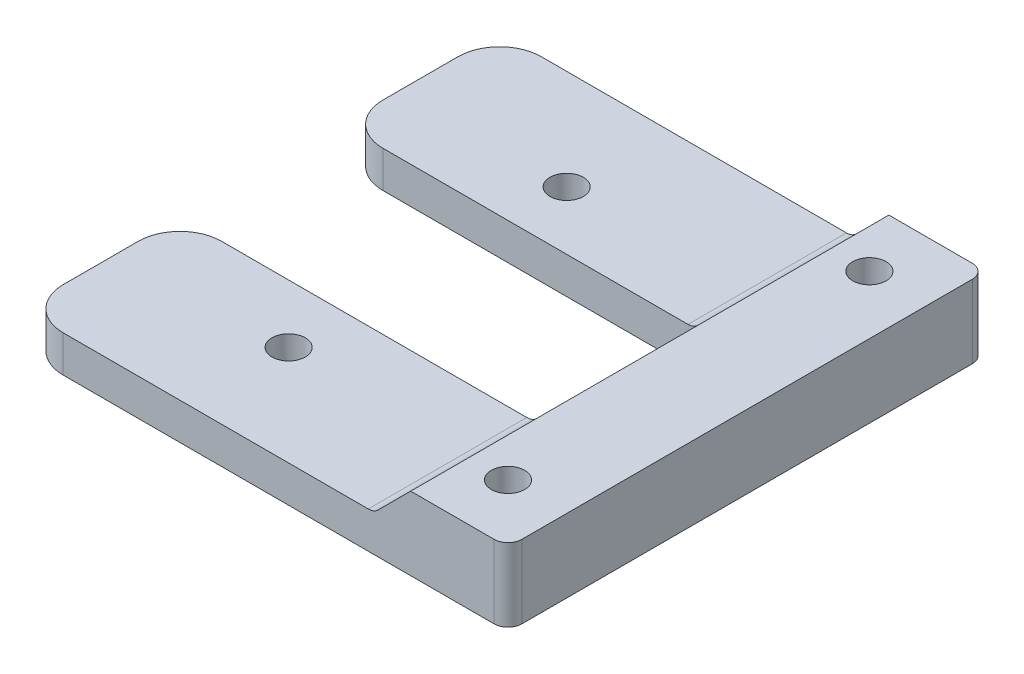
ISO-10303-21;
HEADER;
FILE_DESCRIPTION(('STEP AP214'),'2;1');
FILE_NAME('part.step','',(''),(''),'','','');
FILE_SCHEMA(('AUTOMOTIVE_DESIGN { 1 0 10303 214 1 1 1 1 }'));
ENDSEC;
DATA;
#1=APPLICATION_CONTEXT('core data for automotive mechanical design processes');
#2=APPLICATION_PROTOCOL_DEFINITION('international standard','automotive_design',2000,#1);
#3=PRODUCT_CONTEXT('',#1,'mechanical');
#4=PRODUCT('Part','Part','',(#3));
#5=PRODUCT_RELATED_PRODUCT_CATEGORY('part','',(#4));
#6=PRODUCT_DEFINITION_FORMATION('','',#4);
#7=PRODUCT_DEFINITION_CONTEXT('part definition',#1,'design');
#8=PRODUCT_DEFINITION('design','',#6,#7);
#9=PRODUCT_DEFINITION_SHAPE('','',#8);
#10=(LENGTH_UNIT() NAMED_UNIT(*) SI_UNIT(.MILLI.,.METRE.));
#11=(NAMED_UNIT(*) PLANE_ANGLE_UNIT() SI_UNIT($,.RADIAN.));
#12=(NAMED_UNIT(*) SI_UNIT($,.STERADIAN.) SOLID_ANGLE_UNIT());
#13=UNCERTAINTY_MEASURE_WITH_UNIT(LENGTH_MEASURE(1.E-05),#10,'distance_accuracy_value','');
#14=(GEOMETRIC_REPRESENTATION_CONTEXT(3) GLOBAL_UNCERTAINTY_ASSIGNED_CONTEXT((#13)) GLOBAL_UNIT_ASSIGNED_CONTEXT((#10,
#11,#12)) REPRESENTATION_CONTEXT('',''));
#15=CARTESIAN_POINT('',(0.,0.,0.));
#16=DIRECTION('',(0.,0.,1.));
#17=DIRECTION('',(1.,0.,0.));
#18=AXIS2_PLACEMENT_3D('',#15,#16,#17);
#19=CARTESIAN_POINT('',(0.,-2.635,17.2));
#20=DIRECTION('',(0.,-1.,0.));
#21=DIRECTION('',(1.,0.,0.));
#22=AXIS2_PLACEMENT_3D('',#19,#20,#21);
#23=PLANE('',#22);
#24=CARTESIAN_POINT('',(-22.979761,-2.635,10.));
#25=DIRECTION('',(0.,1.,0.));
#26=DIRECTION('',(-1.,0.,0.));
#27=AXIS2_PLACEMENT_3D('',#24,#25,#26);
#28=CIRCLE('',#27,1.2);
#29=CARTESIAN_POINT('',(-24.179761,-2.635,10.));
#30=VERTEX_POINT('',#29);
#31=EDGE_CURVE('E578',#30,#30,#28,.T.);
#32=ORIENTED_EDGE('',*,*,#31,.F.);
#33=EDGE_LOOP('',(#32));
#34=FACE_BOUND('',#33,.T.);
#35=DIRECTION('',(0.,0.,-1.));
#36=VECTOR('',#35,1.);
#37=CARTESIAN_POINT('',(-35.,-2.63500000000002,17.2));
#38=LINE('',#37,#36);
#39=CARTESIAN_POINT('',(-35.,-2.63500000000002,14.2));
#40=VERTEX_POINT('',#39);
#41=CARTESIAN_POINT('',(-35.,-2.63500000000002,8.8));
#42=VERTEX_POINT('',#41);
#43=EDGE_CURVE('E231',#40,#42,#38,.T.);
#44=ORIENTED_EDGE('',*,*,#43,.F.);
#45=CARTESIAN_POINT('',(-32.,-2.63500000000002,14.2));
#46=DIRECTION('',(0.,-1.,0.));
#47=DIRECTION('',(1.,0.,0.));
#48=AXIS2_PLACEMENT_3D('',#45,#46,#47);
#49=CIRCLE('',#48,3.);
#50=CARTESIAN_POINT('',(-32.,-2.63500000000002,17.2));
#51=VERTEX_POINT('',#50);
#52=EDGE_CURVE('E317',#40,#51,#49,.F.);
#53=ORIENTED_EDGE('',*,*,#52,.T.);
#54=DIRECTION('',(-1.,0.,0.));
#55=VECTOR('',#54,1.);
#56=CARTESIAN_POINT('',(0.,-2.635,17.2));
#57=LINE('',#56,#55);
#58=CARTESIAN_POINT('',(-10.0492135623731,-2.635,17.2));
#59=VERTEX_POINT('',#58);
#60=EDGE_CURVE('E382',#59,#51,#57,.T.);
#61=ORIENTED_EDGE('',*,*,#60,.F.);
#62=DIRECTION('',(0.,0.,1.));
#63=VECTOR('',#62,1.);
#64=CARTESIAN_POINT('',(-10.0492135623731,-2.635,5.8));
#65=LINE('',#64,#63);
#66=CARTESIAN_POINT('',(-10.0492135623731,-2.635,5.8));
#67=VERTEX_POINT('',#66);
#68=EDGE_CURVE('E238',#59,#67,#65,.F.);
#69=ORIENTED_EDGE('',*,*,#68,.T.);
#70=DIRECTION('',(1.,0.,0.));
#71=VECTOR('',#70,1.);
#72=CARTESIAN_POINT('',(-35.,-2.635,5.8));
#73=LINE('',#72,#71);
#74=CARTESIAN_POINT('',(-32.,-2.635,5.8));
#75=VERTEX_POINT('',#74);
#76=EDGE_CURVE('E447',#75,#67,#73,.T.);
#77=ORIENTED_EDGE('',*,*,#76,.F.);
#78=CARTESIAN_POINT('',(-32.,-2.63500000000002,8.8));
#79=DIRECTION('',(0.,-1.,0.));
#80=DIRECTION('',(1.,0.,0.));
#81=AXIS2_PLACEMENT_3D('',#78,#79,#80);
#82=CIRCLE('',#81,3.);
#83=EDGE_CURVE('E314',#75,#42,#82,.F.);
#84=ORIENTED_EDGE('',*,*,#83,.T.);
#85=EDGE_LOOP('',(#44,#53,#61,#69,#77,#84));
#86=FACE_BOUND('',#85,.T.);
#87=ADVANCED_FACE('F50',(#34,#86),#23,.F.);
#88=CARTESIAN_POINT('',(-35.,0.,17.2));
#89=DIRECTION('',(1.,0.,0.));
#90=DIRECTION('',(0.,0.,-1.));
#91=AXIS2_PLACEMENT_3D('',#88,#89,#90);
#92=PLANE('',#91);
#93=DIRECTION('',(0.,0.,-1.));
#94=VECTOR('',#93,1.);
#95=CARTESIAN_POINT('',(-35.,-5.27,17.2));
#96=LINE('',#95,#94);
#97=CARTESIAN_POINT('',(-35.,-5.27,14.2));
#98=VERTEX_POINT('',#97);
#99=CARTESIAN_POINT('',(-35.,-5.27,8.8));
#100=VERTEX_POINT('',#99);
#101=EDGE_CURVE('E404',#98,#100,#96,.T.);
#102=ORIENTED_EDGE('',*,*,#101,.F.);
#103=DIRECTION('',(0.,-1.,0.));
#104=VECTOR('',#103,1.);
#105=CARTESIAN_POINT('',(-35.,-2.63500000000002,14.2));
#106=LINE('',#105,#104);
#107=EDGE_CURVE('E311',#98,#40,#106,.F.);
#108=ORIENTED_EDGE('',*,*,#107,.T.);
#109=ORIENTED_EDGE('',*,*,#43,.T.);
#110=DIRECTION('',(0.,1.,0.));
#111=VECTOR('',#110,1.);
#112=CARTESIAN_POINT('',(-35.,0.,8.8));
#113=LINE('',#112,#111);
#114=EDGE_CURVE('E308',#42,#100,#113,.F.);
#115=ORIENTED_EDGE('',*,*,#114,.T.);
#116=EDGE_LOOP('',(#102,#108,#109,#115));
#117=FACE_BOUND('',#116,.T.);
#118=ADVANCED_FACE('F423',(#117),#92,.F.);
#119=CARTESIAN_POINT('',(-22.979761,-2.635,-10.));
#120=DIRECTION('',(0.,1.,0.));
#121=DIRECTION('',(-1.,0.,0.));
#122=AXIS2_PLACEMENT_3D('',#119,#120,#121);
#123=CIRCLE('',#122,1.2);
#124=CARTESIAN_POINT('',(-24.179761,-2.635,-10.));
#125=VERTEX_POINT('',#124);
#126=EDGE_CURVE('E510',#125,#125,#123,.T.);
#127=ORIENTED_EDGE('',*,*,#126,.F.);
#128=EDGE_LOOP('',(#127));
#129=FACE_BOUND('',#128,.T.);
#130=CARTESIAN_POINT('',(-35.,-2.63500000000002,-8.8));
#131=VERTEX_POINT('',#130);
#132=CARTESIAN_POINT('',(-35.,-2.63500000000002,-14.2));
#133=VERTEX_POINT('',#132);
#134=EDGE_CURVE('E407',#131,#133,#38,.T.);
#135=ORIENTED_EDGE('',*,*,#134,.F.);
#136=CARTESIAN_POINT('',(-32.,-2.63500000000002,-8.8));
#137=DIRECTION('',(0.,-1.,0.));
#138=DIRECTION('',(1.,0.,0.));
#139=AXIS2_PLACEMENT_3D('',#136,#137,#138);
#140=CIRCLE('',#139,3.);
#141=CARTESIAN_POINT('',(-32.,-2.635,-5.8));
#142=VERTEX_POINT('',#141);
#143=EDGE_CURVE('E335',#131,#142,#140,.F.);
#144=ORIENTED_EDGE('',*,*,#143,.T.);
#145=DIRECTION('',(-1.,0.,0.));
#146=VECTOR('',#145,1.);
#147=CARTESIAN_POINT('',(-35.,-2.635,-5.8));
#148=LINE('',#147,#146);
#149=CARTESIAN_POINT('',(-10.0492135623731,-2.635,-5.8));
#150=VERTEX_POINT('',#149);
#151=EDGE_CURVE('E439',#150,#142,#148,.T.);
#152=ORIENTED_EDGE('',*,*,#151,.F.);
#153=DIRECTION('',(0.,0.,1.));
#154=VECTOR('',#153,1.);
#155=CARTESIAN_POINT('',(-10.0492135623731,-2.635,-17.2));
#156=LINE('',#155,#154);
#157=CARTESIAN_POINT('',(-10.0492135623731,-2.635,-17.2));
#158=VERTEX_POINT('',#157);
#159=EDGE_CURVE('E244',#150,#158,#156,.F.);
#160=ORIENTED_EDGE('',*,*,#159,.T.);
#161=DIRECTION('',(-1.,0.,0.));
#162=VECTOR('',#161,1.);
#163=CARTESIAN_POINT('',(0.,-2.635,-17.2));
#164=LINE('',#163,#162);
#165=CARTESIAN_POINT('',(-32.,-2.63500000000002,-17.2));
#166=VERTEX_POINT('',#165);
#167=EDGE_CURVE('E391',#158,#166,#164,.T.);
#168=ORIENTED_EDGE('',*,*,#167,.T.);
#169=CARTESIAN_POINT('',(-32.,-2.63500000000002,-14.2));
#170=DIRECTION('',(0.,-1.,0.));
#171=DIRECTION('',(1.,0.,0.));
#172=AXIS2_PLACEMENT_3D('',#169,#170,#171);
#173=CIRCLE('',#172,3.);
#174=EDGE_CURVE('E332',#166,#133,#173,.F.);
#175=ORIENTED_EDGE('',*,*,#174,.T.);
#176=EDGE_LOOP('',(#135,#144,#152,#160,#168,#175));
#177=FACE_BOUND('',#176,.T.);
#178=ADVANCED_FACE('F494',(#129,#177),#23,.F.);
#179=CARTESIAN_POINT('',(-35.,-5.27,-8.8));
#180=VERTEX_POINT('',#179);
#181=CARTESIAN_POINT('',(-35.,-5.27,-14.2));
#182=VERTEX_POINT('',#181);
#183=EDGE_CURVE('E403',#180,#182,#96,.T.);
#184=ORIENTED_EDGE('',*,*,#183,.F.);
#185=DIRECTION('',(0.,1.,0.));
#186=VECTOR('',#185,1.);
#187=CARTESIAN_POINT('',(-35.,0.,-8.8));
#188=LINE('',#187,#186);
#189=EDGE_CURVE('E328',#180,#131,#188,.T.);
#190=ORIENTED_EDGE('',*,*,#189,.T.);
#191=ORIENTED_EDGE('',*,*,#134,.T.);
#192=DIRECTION('',(0.,-1.,0.));
#193=VECTOR('',#192,1.);
#194=CARTESIAN_POINT('',(-35.,0.,-14.2));
#195=LINE('',#194,#193);
#196=EDGE_CURVE('E324',#133,#182,#195,.T.);
#197=ORIENTED_EDGE('',*,*,#196,.T.);
#198=EDGE_LOOP('',(#184,#190,#191,#197));
#199=FACE_BOUND('',#198,.T.);
#200=ADVANCED_FACE('F499',(#199),#92,.F.);
#201=CARTESIAN_POINT('',(0.,-5.27,17.2));
#202=DIRECTION('',(0.,-1.,0.));
#203=DIRECTION('',(1.,0.,0.));
#204=AXIS2_PLACEMENT_3D('',#201,#202,#203);
#205=PLANE('',#204);
#206=CARTESIAN_POINT('',(-22.979761,-5.27,10.));
#207=DIRECTION('',(0.,-1.,0.));
#208=DIRECTION('',(1.,0.,0.));
#209=AXIS2_PLACEMENT_3D('',#206,#207,#208);
#210=CIRCLE('',#209,1.2);
#211=CARTESIAN_POINT('',(-21.779761,-5.27,10.));
#212=VERTEX_POINT('',#211);
#213=EDGE_CURVE('E572',#212,#212,#210,.F.);
#214=ORIENTED_EDGE('',*,*,#213,.T.);
#215=EDGE_LOOP('',(#214));
#216=FACE_BOUND('',#215,.T.);
#217=CARTESIAN_POINT('',(-22.979761,-5.27,-10.));
#218=DIRECTION('',(0.,-1.,0.));
#219=DIRECTION('',(1.,0.,0.));
#220=AXIS2_PLACEMENT_3D('',#217,#218,#219);
#221=CIRCLE('',#220,1.2);
#222=CARTESIAN_POINT('',(-21.779761,-5.27,-10.));
#223=VERTEX_POINT('',#222);
#224=EDGE_CURVE('E450',#223,#223,#221,.F.);
#225=ORIENTED_EDGE('',*,*,#224,.T.);
#226=EDGE_LOOP('',(#225));
#227=FACE_BOUND('',#226,.T.);
#228=DIRECTION('',(0.,0.,-1.));
#229=VECTOR('',#228,1.);
#230=CARTESIAN_POINT('',(0.,-5.27,17.2));
#231=LINE('',#230,#229);
#232=CARTESIAN_POINT('',(0.,-5.27,16.2));
#233=VERTEX_POINT('',#232);
#234=CARTESIAN_POINT('',(0.,-5.27,-16.2));
#235=VERTEX_POINT('',#234);
#236=EDGE_CURVE('E372',#233,#235,#231,.T.);
#237=ORIENTED_EDGE('',*,*,#236,.F.);
#238=CARTESIAN_POINT('',(-1.,-5.27,16.2));
#239=DIRECTION('',(0.,-1.,0.));
#240=DIRECTION('',(1.,0.,0.));
#241=AXIS2_PLACEMENT_3D('',#238,#239,#240);
#242=CIRCLE('',#241,1.);
#243=CARTESIAN_POINT('',(-1.,-5.27,17.2));
#244=VERTEX_POINT('',#243);
#245=EDGE_CURVE('E354',#233,#244,#242,.T.);
#246=ORIENTED_EDGE('',*,*,#245,.T.);
#247=DIRECTION('',(-1.,0.,0.));
#248=VECTOR('',#247,1.);
#249=CARTESIAN_POINT('',(0.,-5.27,17.2));
#250=LINE('',#249,#248);
#251=CARTESIAN_POINT('',(-32.,-5.27,17.2));
#252=VERTEX_POINT('',#251);
#253=EDGE_CURVE('E203',#244,#252,#250,.T.);
#254=ORIENTED_EDGE('',*,*,#253,.T.);
#255=CARTESIAN_POINT('',(-32.,-5.27,14.2));
#256=DIRECTION('',(0.,-1.,0.));
#257=DIRECTION('',(1.,0.,0.));
#258=AXIS2_PLACEMENT_3D('',#255,#256,#257);
#259=CIRCLE('',#258,3.);
#260=EDGE_CURVE('E305',#252,#98,#259,.T.);
#261=ORIENTED_EDGE('',*,*,#260,.T.);
#262=ORIENTED_EDGE('',*,*,#101,.T.);
#263=CARTESIAN_POINT('',(-32.,-5.27,8.8));
#264=DIRECTION('',(0.,-1.,0.));
#265=DIRECTION('',(1.,0.,0.));
#266=AXIS2_PLACEMENT_3D('',#263,#264,#265);
#267=CIRCLE('',#266,3.);
#268=CARTESIAN_POINT('',(-32.,-5.27,5.8));
#269=VERTEX_POINT('',#268);
#270=EDGE_CURVE('E302',#100,#269,#267,.T.);
#271=ORIENTED_EDGE('',*,*,#270,.T.);
#272=DIRECTION('',(1.,0.,0.));
#273=VECTOR('',#272,1.);
#274=CARTESIAN_POINT('',(-35.,-5.27,5.8));
#275=LINE('',#274,#273);
#276=CARTESIAN_POINT('',(-8.,-5.27,5.8));
#277=VERTEX_POINT('',#276);
#278=EDGE_CURVE('E432',#269,#277,#275,.T.);
#279=ORIENTED_EDGE('',*,*,#278,.T.);
#280=CARTESIAN_POINT('',(-8.,-5.27,4.8));
#281=DIRECTION('',(0.,-1.,0.));
#282=DIRECTION('',(1.,0.,0.));
#283=AXIS2_PLACEMENT_3D('',#280,#281,#282);
#284=CIRCLE('',#283,1.);
#285=CARTESIAN_POINT('',(-7.,-5.27,4.8));
#286=VERTEX_POINT('',#285);
#287=EDGE_CURVE('E288',#277,#286,#284,.F.);
#288=ORIENTED_EDGE('',*,*,#287,.T.);
#289=DIRECTION('',(0.,0.,-1.));
#290=VECTOR('',#289,1.);
#291=CARTESIAN_POINT('',(-7.,-5.27,5.8));
#292=LINE('',#291,#290);
#293=CARTESIAN_POINT('',(-7.,-5.27,-4.8));
#294=VERTEX_POINT('',#293);
#295=EDGE_CURVE('E440',#286,#294,#292,.T.);
#296=ORIENTED_EDGE('',*,*,#295,.T.);
#297=CARTESIAN_POINT('',(-8.,-5.27,-4.8));
#298=DIRECTION('',(0.,-1.,0.));
#299=DIRECTION('',(1.,0.,0.));
#300=AXIS2_PLACEMENT_3D('',#297,#298,#299);
#301=CIRCLE('',#300,1.);
#302=CARTESIAN_POINT('',(-8.,-5.27,-5.8));
#303=VERTEX_POINT('',#302);
#304=EDGE_CURVE('E282',#294,#303,#301,.F.);
#305=ORIENTED_EDGE('',*,*,#304,.T.);
#306=DIRECTION('',(-1.,0.,0.));
#307=VECTOR('',#306,1.);
#308=CARTESIAN_POINT('',(-35.,-5.27,-5.8));
#309=LINE('',#308,#307);
#310=CARTESIAN_POINT('',(-32.,-5.27,-5.8));
#311=VERTEX_POINT('',#310);
#312=EDGE_CURVE('E456',#303,#311,#309,.T.);
#313=ORIENTED_EDGE('',*,*,#312,.T.);
#314=CARTESIAN_POINT('',(-32.,-5.27,-8.8));
#315=DIRECTION('',(0.,-1.,0.));
#316=DIRECTION('',(1.,0.,0.));
#317=AXIS2_PLACEMENT_3D('',#314,#315,#316);
#318=CIRCLE('',#317,3.);
#319=EDGE_CURVE('E299',#311,#180,#318,.T.);
#320=ORIENTED_EDGE('',*,*,#319,.T.);
#321=ORIENTED_EDGE('',*,*,#183,.T.);
#322=CARTESIAN_POINT('',(-32.,-5.27,-14.2));
#323=DIRECTION('',(0.,-1.,0.));
#324=DIRECTION('',(1.,0.,0.));
#325=AXIS2_PLACEMENT_3D('',#322,#323,#324);
#326=CIRCLE('',#325,3.);
#327=CARTESIAN_POINT('',(-32.,-5.27,-17.2));
#328=VERTEX_POINT('',#327);
#329=EDGE_CURVE('E295',#182,#328,#326,.T.);
#330=ORIENTED_EDGE('',*,*,#329,.T.);
#331=DIRECTION('',(-1.,0.,0.));
#332=VECTOR('',#331,1.);
#333=CARTESIAN_POINT('',(0.,-5.27,-17.2));
#334=LINE('',#333,#332);
#335=CARTESIAN_POINT('',(-1.,-5.27,-17.2));
#336=VERTEX_POINT('',#335);
#337=EDGE_CURVE('E395',#336,#328,#334,.T.);
#338=ORIENTED_EDGE('',*,*,#337,.F.);
#339=CARTESIAN_POINT('',(-1.,-5.27,-16.2));
#340=DIRECTION('',(0.,-1.,0.));
#341=DIRECTION('',(1.,0.,0.));
#342=AXIS2_PLACEMENT_3D('',#339,#340,#341);
#343=CIRCLE('',#342,1.);
#344=EDGE_CURVE('E351',#336,#235,#343,.T.);
#345=ORIENTED_EDGE('',*,*,#344,.T.);
#346=EDGE_LOOP('',(#237,#246,#254,#261,#262,#271,#279,#288,#296,#305,#313,#320,#321,#330,#338,#345));
#347=FACE_BOUND('',#346,.T.);
#348=CARTESIAN_POINT('',(-4.2,-5.27,-13.));
#349=DIRECTION('',(0.,-1.,0.));
#350=DIRECTION('',(1.,0.,0.));
#351=AXIS2_PLACEMENT_3D('',#348,#349,#350);
#352=CIRCLE('',#351,1.2);
#353=CARTESIAN_POINT('',(-3.,-5.27,-13.));
#354=VERTEX_POINT('',#353);
#355=EDGE_CURVE('E464',#354,#354,#352,.F.);
#356=ORIENTED_EDGE('',*,*,#355,.T.);
#357=EDGE_LOOP('',(#356));
#358=FACE_BOUND('',#357,.T.);
#359=CARTESIAN_POINT('',(-4.2,-5.27,13.));
#360=DIRECTION('',(0.,-1.,0.));
#361=DIRECTION('',(1.,0.,0.));
#362=AXIS2_PLACEMENT_3D('',#359,#360,#361);
#363=CIRCLE('',#362,1.2);
#364=CARTESIAN_POINT('',(-3.,-5.27,13.));
#365=VERTEX_POINT('',#364);
#366=EDGE_CURVE('E468',#365,#365,#363,.F.);
#367=ORIENTED_EDGE('',*,*,#366,.T.);
#368=EDGE_LOOP('',(#367));
#369=FACE_BOUND('',#368,.T.);
#370=ADVANCED_FACE('F376',(#216,#227,#347,#358,#369),#205,.T.);
#371=CARTESIAN_POINT('',(0.,0.,17.2));
#372=DIRECTION('',(1.,0.,0.));
#373=DIRECTION('',(0.,0.,-1.));
#374=AXIS2_PLACEMENT_3D('',#371,#372,#373);
#375=PLANE('',#374);
#376=DIRECTION('',(0.,0.,-1.));
#377=VECTOR('',#376,1.);
#378=CARTESIAN_POINT('',(0.,0.,17.2));
#379=LINE('',#378,#377);
#380=CARTESIAN_POINT('',(0.,0.,16.2));
#381=VERTEX_POINT('',#380);
#382=CARTESIAN_POINT('',(0.,0.,-16.2));
#383=VERTEX_POINT('',#382);
#384=EDGE_CURVE('E213',#381,#383,#379,.T.);
#385=ORIENTED_EDGE('',*,*,#384,.F.);
#386=DIRECTION('',(0.,-1.,0.));
#387=VECTOR('',#386,1.);
#388=CARTESIAN_POINT('',(0.,0.,16.2));
#389=LINE('',#388,#387);
#390=EDGE_CURVE('E347',#381,#233,#389,.T.);
#391=ORIENTED_EDGE('',*,*,#390,.T.);
#392=ORIENTED_EDGE('',*,*,#236,.T.);
#393=DIRECTION('',(0.,-1.,0.));
#394=VECTOR('',#393,1.);
#395=CARTESIAN_POINT('',(0.,0.,-16.2));
#396=LINE('',#395,#394);
#397=EDGE_CURVE('E344',#235,#383,#396,.F.);
#398=ORIENTED_EDGE('',*,*,#397,.T.);
#399=EDGE_LOOP('',(#385,#391,#392,#398));
#400=FACE_BOUND('',#399,.T.);
#401=ADVANCED_FACE('F367',(#400),#375,.T.);
#402=CARTESIAN_POINT('',(0.,0.,17.2));
#403=DIRECTION('',(0.,-1.,0.));
#404=DIRECTION('',(1.,0.,0.));
#405=AXIS2_PLACEMENT_3D('',#402,#403,#404);
#406=PLANE('',#405);
#407=CARTESIAN_POINT('',(-4.2,0.,-13.));
#408=DIRECTION('',(0.,1.,0.));
#409=DIRECTION('',(0.,0.,1.));
#410=AXIS2_PLACEMENT_3D('',#407,#408,#409);
#411=CIRCLE('',#410,1.2);
#412=CARTESIAN_POINT('',(-4.2,0.,-11.8));
#413=VERTEX_POINT('',#412);
#414=EDGE_CURVE('E396',#413,#413,#411,.T.);
#415=ORIENTED_EDGE('',*,*,#414,.F.);
#416=EDGE_LOOP('',(#415));
#417=FACE_BOUND('',#416,.T.);
#418=CARTESIAN_POINT('',(-4.2,0.,13.));
#419=DIRECTION('',(0.,1.,0.));
#420=DIRECTION('',(0.,0.,1.));
#421=AXIS2_PLACEMENT_3D('',#418,#419,#420);
#422=CIRCLE('',#421,1.2);
#423=CARTESIAN_POINT('',(-4.2,0.,14.2));
#424=VERTEX_POINT('',#423);
#425=EDGE_CURVE('E460',#424,#424,#422,.T.);
#426=ORIENTED_EDGE('',*,*,#425,.F.);
#427=EDGE_LOOP('',(#426));
#428=FACE_BOUND('',#427,.T.);
#429=DIRECTION('',(-1.,0.,0.));
#430=VECTOR('',#429,1.);
#431=CARTESIAN_POINT('',(0.,0.,17.2));
#432=LINE('',#431,#430);
#433=CARTESIAN_POINT('',(-1.,0.,17.2));
#434=VERTEX_POINT('',#433);
#435=CARTESIAN_POINT('',(-7.,0.,17.2));
#436=VERTEX_POINT('',#435);
#437=EDGE_CURVE('E194',#434,#436,#432,.T.);
#438=ORIENTED_EDGE('',*,*,#437,.F.);
#439=CARTESIAN_POINT('',(-1.,0.,16.2));
#440=DIRECTION('',(0.,-1.,0.));
#441=DIRECTION('',(1.,0.,0.));
#442=AXIS2_PLACEMENT_3D('',#439,#440,#441);
#443=CIRCLE('',#442,1.);
#444=EDGE_CURVE('E59',#434,#381,#443,.F.);
#445=ORIENTED_EDGE('',*,*,#444,.T.);
#446=ORIENTED_EDGE('',*,*,#384,.T.);
#447=CARTESIAN_POINT('',(-1.,0.,-16.2));
#448=DIRECTION('',(0.,-1.,0.));
#449=DIRECTION('',(1.,0.,0.));
#450=AXIS2_PLACEMENT_3D('',#447,#448,#449);
#451=CIRCLE('',#450,1.);
#452=CARTESIAN_POINT('',(-1.,0.,-17.2));
#453=VERTEX_POINT('',#452);
#454=EDGE_CURVE('E66',#383,#453,#451,.F.);
#455=ORIENTED_EDGE('',*,*,#454,.T.);
#456=DIRECTION('',(-1.,0.,0.));
#457=VECTOR('',#456,1.);
#458=CARTESIAN_POINT('',(0.,0.,-17.2));
#459=LINE('',#458,#457);
#460=CARTESIAN_POINT('',(-7.,0.,-17.2));
#461=VERTEX_POINT('',#460);
#462=EDGE_CURVE('E387',#453,#461,#459,.T.);
#463=ORIENTED_EDGE('',*,*,#462,.T.);
#464=DIRECTION('',(0.,0.,-1.));
#465=VECTOR('',#464,1.);
#466=CARTESIAN_POINT('',(-7.,0.,17.2));
#467=LINE('',#466,#465);
#468=CARTESIAN_POINT('',(-7.,0.,-4.79999999999999));
#469=VERTEX_POINT('',#468);
#470=EDGE_CURVE('E202',#469,#461,#467,.T.);
#471=ORIENTED_EDGE('',*,*,#470,.F.);
#472=CARTESIAN_POINT('',(-7.,0.,4.80000000000001));
#473=VERTEX_POINT('',#472);
#474=EDGE_CURVE('E209',#473,#469,#467,.T.);
#475=ORIENTED_EDGE('',*,*,#474,.F.);
#476=EDGE_CURVE('E206',#436,#473,#467,.T.);
#477=ORIENTED_EDGE('',*,*,#476,.F.);
#478=EDGE_LOOP('',(#438,#445,#446,#455,#463,#471,#475,#477));
#479=FACE_BOUND('',#478,.T.);
#480=ADVANCED_FACE('F207',(#417,#428,#479),#406,.F.);
#481=CARTESIAN_POINT('',(-7.,0.,17.2));
#482=DIRECTION('',(1.,0.,0.));
#483=DIRECTION('',(0.,0.,-1.));
#484=AXIS2_PLACEMENT_3D('',#481,#482,#483);
#485=PLANE('',#484);
#486=ORIENTED_EDGE('',*,*,#474,.T.);
#487=DIRECTION('',(0.,1.,0.));
#488=VECTOR('',#487,1.);
#489=CARTESIAN_POINT('',(-7.,-5.27,-4.8));
#490=LINE('',#489,#488);
#491=EDGE_CURVE('E259',#469,#294,#490,.F.);
#492=ORIENTED_EDGE('',*,*,#491,.T.);
#493=ORIENTED_EDGE('',*,*,#295,.F.);
#494=DIRECTION('',(0.,1.,0.));
#495=VECTOR('',#494,1.);
#496=CARTESIAN_POINT('',(-7.,0.,4.8));
#497=LINE('',#496,#495);
#498=EDGE_CURVE('E255',#286,#473,#497,.T.);
#499=ORIENTED_EDGE('',*,*,#498,.T.);
#500=EDGE_LOOP('',(#486,#492,#493,#499));
#501=FACE_BOUND('',#500,.T.);
#502=ADVANCED_FACE('F480',(#501),#485,.F.);
#503=CARTESIAN_POINT('',(0.,0.,17.2));
#504=DIRECTION('',(0.,0.,1.));
#505=DIRECTION('',(1.,0.,0.));
#506=AXIS2_PLACEMENT_3D('',#503,#504,#505);
#507=PLANE('',#506);
#508=ORIENTED_EDGE('',*,*,#253,.F.);
#509=DIRECTION('',(0.,-1.,0.));
#510=VECTOR('',#509,1.);
#511=CARTESIAN_POINT('',(-1.,0.,17.2));
#512=LINE('',#511,#510);
#513=EDGE_CURVE('E74',#244,#434,#512,.F.);
#514=ORIENTED_EDGE('',*,*,#513,.T.);
#515=ORIENTED_EDGE('',*,*,#437,.T.);
#516=DIRECTION('',(0.707106781186547,0.707106781186548,0.));
#517=VECTOR('',#516,1.);
#518=CARTESIAN_POINT('',(-9.63499999999999,-2.635,17.2));
#519=LINE('',#518,#517);
#520=CARTESIAN_POINT('',(-9.34210678118654,-2.34210678118655,17.2));
#521=VERTEX_POINT('',#520);
#522=EDGE_CURVE('E198',#436,#521,#519,.F.);
#523=ORIENTED_EDGE('',*,*,#522,.T.);
#524=CARTESIAN_POINT('',(-10.0492135623731,-1.635,17.2));
#525=DIRECTION('',(0.,0.,1.));
#526=DIRECTION('',(1.,0.,0.));
#527=AXIS2_PLACEMENT_3D('',#524,#525,#526);
#528=CIRCLE('',#527,1.);
#529=EDGE_CURVE('E269',#521,#59,#528,.F.);
#530=ORIENTED_EDGE('',*,*,#529,.T.);
#531=ORIENTED_EDGE('',*,*,#60,.T.);
#532=DIRECTION('',(0.,-1.,0.));
#533=VECTOR('',#532,1.);
#534=CARTESIAN_POINT('',(-32.,-5.27,17.2));
#535=LINE('',#534,#533);
#536=EDGE_CURVE('E291',#51,#252,#535,.T.);
#537=ORIENTED_EDGE('',*,*,#536,.T.);
#538=EDGE_LOOP('',(#508,#514,#515,#523,#530,#531,#537));
#539=FACE_BOUND('',#538,.T.);
#540=ADVANCED_FACE('F196',(#539),#507,.T.);
#541=CARTESIAN_POINT('',(0.,0.,-17.2));
#542=DIRECTION('',(0.,0.,1.));
#543=DIRECTION('',(1.,0.,0.));
#544=AXIS2_PLACEMENT_3D('',#541,#542,#543);
#545=PLANE('',#544);
#546=ORIENTED_EDGE('',*,*,#462,.F.);
#547=DIRECTION('',(0.,-1.,0.));
#548=VECTOR('',#547,1.);
#549=CARTESIAN_POINT('',(-1.,-5.27,-17.2));
#550=LINE('',#549,#548);
#551=EDGE_CURVE('E11',#453,#336,#550,.T.);
#552=ORIENTED_EDGE('',*,*,#551,.T.);
#553=ORIENTED_EDGE('',*,*,#337,.T.);
#554=DIRECTION('',(0.,-1.,0.));
#555=VECTOR('',#554,1.);
#556=CARTESIAN_POINT('',(-32.,0.,-17.2));
#557=LINE('',#556,#555);
#558=EDGE_CURVE('E341',#328,#166,#557,.F.);
#559=ORIENTED_EDGE('',*,*,#558,.T.);
#560=ORIENTED_EDGE('',*,*,#167,.F.);
#561=CARTESIAN_POINT('',(-10.0492135623731,-1.635,-17.2));
#562=DIRECTION('',(0.,0.,1.));
#563=DIRECTION('',(1.,0.,0.));
#564=AXIS2_PLACEMENT_3D('',#561,#562,#563);
#565=CIRCLE('',#564,1.);
#566=CARTESIAN_POINT('',(-9.34210678118654,-2.34210678118655,-17.2));
#567=VERTEX_POINT('',#566);
#568=EDGE_CURVE('E272',#158,#567,#565,.T.);
#569=ORIENTED_EDGE('',*,*,#568,.T.);
#570=DIRECTION('',(-0.707106781186547,-0.707106781186548,0.));
#571=VECTOR('',#570,1.);
#572=CARTESIAN_POINT('',(-3.49999999999999,3.49999999999999,-17.2));
#573=LINE('',#572,#571);
#574=EDGE_CURVE('E220',#567,#461,#573,.F.);
#575=ORIENTED_EDGE('',*,*,#574,.T.);
#576=EDGE_LOOP('',(#546,#552,#553,#559,#560,#569,#575));
#577=FACE_BOUND('',#576,.T.);
#578=ADVANCED_FACE('F611',(#577),#545,.F.);
#579=CARTESIAN_POINT('',(-4.2,-5.271,13.));
#580=DIRECTION('',(0.,1.,0.));
#581=DIRECTION('',(0.,0.,1.));
#582=AXIS2_PLACEMENT_3D('',#579,#580,#581);
#583=CYLINDRICAL_SURFACE('',#582,1.2);
#584=ORIENTED_EDGE('',*,*,#366,.F.);
#585=EDGE_LOOP('',(#584));
#586=FACE_BOUND('',#585,.T.);
#587=ORIENTED_EDGE('',*,*,#425,.T.);
#588=EDGE_LOOP('',(#587));
#589=FACE_BOUND('',#588,.T.);
#590=ADVANCED_FACE('F477',(#586,#589),#583,.F.);
#591=CARTESIAN_POINT('',(-4.2,-5.271,-13.));
#592=DIRECTION('',(0.,1.,0.));
#593=DIRECTION('',(0.,0.,1.));
#594=AXIS2_PLACEMENT_3D('',#591,#592,#593);
#595=CYLINDRICAL_SURFACE('',#594,1.2);
#596=ORIENTED_EDGE('',*,*,#355,.F.);
#597=EDGE_LOOP('',(#596));
#598=FACE_BOUND('',#597,.T.);
#599=ORIENTED_EDGE('',*,*,#414,.T.);
#600=EDGE_LOOP('',(#599));
#601=FACE_BOUND('',#600,.T.);
#602=ADVANCED_FACE('F602',(#598,#601),#595,.F.);
#603=CARTESIAN_POINT('',(-35.,-5.27100000000001,5.8));
#604=DIRECTION('',(0.,0.,1.));
#605=DIRECTION('',(1.,0.,0.));
#606=AXIS2_PLACEMENT_3D('',#603,#604,#605);
#607=PLANE('',#606);
#608=ORIENTED_EDGE('',*,*,#278,.F.);
#609=DIRECTION('',(0.,1.,0.));
#610=VECTOR('',#609,1.);
#611=CARTESIAN_POINT('',(-32.,-5.27100000000001,5.8));
#612=LINE('',#611,#610);
#613=EDGE_CURVE('E320',#269,#75,#612,.T.);
#614=ORIENTED_EDGE('',*,*,#613,.T.);
#615=ORIENTED_EDGE('',*,*,#76,.T.);
#616=CARTESIAN_POINT('',(-10.0492135623731,-1.635,5.8));
#617=DIRECTION('',(0.,0.,1.));
#618=DIRECTION('',(1.,0.,0.));
#619=AXIS2_PLACEMENT_3D('',#616,#617,#618);
#620=CIRCLE('',#619,1.);
#621=CARTESIAN_POINT('',(-9.34210678118654,-2.34210678118655,5.8));
#622=VERTEX_POINT('',#621);
#623=EDGE_CURVE('E266',#67,#622,#620,.T.);
#624=ORIENTED_EDGE('',*,*,#623,.T.);
#625=DIRECTION('',(-0.707106781186547,-0.707106781186548,0.));
#626=VECTOR('',#625,1.);
#627=CARTESIAN_POINT('',(-23.6355,-16.6355,5.8));
#628=LINE('',#627,#626);
#629=CARTESIAN_POINT('',(-8.,-1.00000000000001,5.8));
#630=VERTEX_POINT('',#629);
#631=EDGE_CURVE('E221',#622,#630,#628,.F.);
#632=ORIENTED_EDGE('',*,*,#631,.T.);
#633=DIRECTION('',(0.,1.,0.));
#634=VECTOR('',#633,1.);
#635=CARTESIAN_POINT('',(-8.,-5.27,5.8));
#636=LINE('',#635,#634);
#637=EDGE_CURVE('E262',#630,#277,#636,.F.);
#638=ORIENTED_EDGE('',*,*,#637,.T.);
#639=EDGE_LOOP('',(#608,#614,#615,#624,#632,#638));
#640=FACE_BOUND('',#639,.T.);
#641=ADVANCED_FACE('F434',(#640),#607,.F.);
#642=CARTESIAN_POINT('',(-35.,-5.27100000000001,-5.8));
#643=DIRECTION('',(0.,0.,-1.));
#644=DIRECTION('',(-1.,0.,0.));
#645=AXIS2_PLACEMENT_3D('',#642,#643,#644);
#646=PLANE('',#645);
#647=ORIENTED_EDGE('',*,*,#151,.T.);
#648=DIRECTION('',(0.,1.,0.));
#649=VECTOR('',#648,1.);
#650=CARTESIAN_POINT('',(-32.,-5.27100000000001,-5.8));
#651=LINE('',#650,#649);
#652=EDGE_CURVE('E338',#142,#311,#651,.F.);
#653=ORIENTED_EDGE('',*,*,#652,.T.);
#654=ORIENTED_EDGE('',*,*,#312,.F.);
#655=DIRECTION('',(0.,1.,0.));
#656=VECTOR('',#655,1.);
#657=CARTESIAN_POINT('',(-8.,0.,-5.8));
#658=LINE('',#657,#656);
#659=CARTESIAN_POINT('',(-8.,-1.00000000000001,-5.8));
#660=VERTEX_POINT('',#659);
#661=EDGE_CURVE('E251',#303,#660,#658,.T.);
#662=ORIENTED_EDGE('',*,*,#661,.T.);
#663=DIRECTION('',(0.707106781186547,0.707106781186548,0.));
#664=VECTOR('',#663,1.);
#665=CARTESIAN_POINT('',(-23.6355,-16.6355,-5.8));
#666=LINE('',#665,#664);
#667=CARTESIAN_POINT('',(-9.34210678118654,-2.34210678118655,-5.8));
#668=VERTEX_POINT('',#667);
#669=EDGE_CURVE('E228',#660,#668,#666,.F.);
#670=ORIENTED_EDGE('',*,*,#669,.T.);
#671=CARTESIAN_POINT('',(-10.0492135623731,-1.635,-5.8));
#672=DIRECTION('',(0.,0.,-1.));
#673=DIRECTION('',(-1.,0.,0.));
#674=AXIS2_PLACEMENT_3D('',#671,#672,#673);
#675=CIRCLE('',#674,1.);
#676=EDGE_CURVE('E275',#668,#150,#675,.T.);
#677=ORIENTED_EDGE('',*,*,#676,.T.);
#678=EDGE_LOOP('',(#647,#653,#654,#662,#670,#677));
#679=FACE_BOUND('',#678,.T.);
#680=ADVANCED_FACE('F595',(#679),#646,.F.);
#681=CARTESIAN_POINT('',(-22.979761,-5.27100000000001,-10.));
#682=DIRECTION('',(0.,1.,0.));
#683=DIRECTION('',(-1.,0.,0.));
#684=AXIS2_PLACEMENT_3D('',#681,#682,#683);
#685=CYLINDRICAL_SURFACE('',#684,1.2);
#686=ORIENTED_EDGE('',*,*,#224,.F.);
#687=EDGE_LOOP('',(#686));
#688=FACE_BOUND('',#687,.T.);
#689=ORIENTED_EDGE('',*,*,#126,.T.);
#690=EDGE_LOOP('',(#689));
#691=FACE_BOUND('',#690,.T.);
#692=ADVANCED_FACE('F587',(#688,#691),#685,.F.);
#693=CARTESIAN_POINT('',(-22.979761,-5.27100000000001,10.));
#694=DIRECTION('',(0.,1.,0.));
#695=DIRECTION('',(-1.,0.,0.));
#696=AXIS2_PLACEMENT_3D('',#693,#694,#695);
#697=CYLINDRICAL_SURFACE('',#696,1.2);
#698=ORIENTED_EDGE('',*,*,#213,.F.);
#699=EDGE_LOOP('',(#698));
#700=FACE_BOUND('',#699,.T.);
#701=ORIENTED_EDGE('',*,*,#31,.T.);
#702=EDGE_LOOP('',(#701));
#703=FACE_BOUND('',#702,.T.);
#704=ADVANCED_FACE('F585',(#700,#703),#697,.F.);
#705=CARTESIAN_POINT('',(-9.63499999999999,-2.635,17.2));
#706=DIRECTION('',(-0.707106781186548,0.707106781186547,0.));
#707=DIRECTION('',(0.,0.,1.));
#708=AXIS2_PLACEMENT_3D('',#705,#706,#707);
#709=PLANE('',#708);
#710=ORIENTED_EDGE('',*,*,#631,.F.);
#711=DIRECTION('',(0.,0.,-1.));
#712=VECTOR('',#711,1.);
#713=CARTESIAN_POINT('',(-9.34210678118654,-2.34210678118655,17.2));
#714=LINE('',#713,#712);
#715=EDGE_CURVE('E218',#622,#521,#714,.F.);
#716=ORIENTED_EDGE('',*,*,#715,.T.);
#717=ORIENTED_EDGE('',*,*,#522,.F.);
#718=ORIENTED_EDGE('',*,*,#476,.T.);
#719=CARTESIAN_POINT('',(-8.,-1.00000000000001,4.8));
#720=DIRECTION('',(-0.707106781186548,0.707106781186547,0.));
#721=DIRECTION('',(-0.707106781186547,-0.707106781186548,0.));
#722=AXIS2_PLACEMENT_3D('',#719,#720,#721);
#723=ELLIPSE('',#722,1.4142135623731,1.);
#724=EDGE_CURVE('E285',#473,#630,#723,.F.);
#725=ORIENTED_EDGE('',*,*,#724,.T.);
#726=EDGE_LOOP('',(#710,#716,#717,#718,#725));
#727=FACE_BOUND('',#726,.T.);
#728=ADVANCED_FACE('F216',(#727),#709,.T.);
#729=CARTESIAN_POINT('',(-9.63499999999999,-2.635,17.2));
#730=DIRECTION('',(-0.707106781186548,0.707106781186547,0.));
#731=DIRECTION('',(0.,0.,1.));
#732=AXIS2_PLACEMENT_3D('',#729,#730,#731);
#733=PLANE('',#732);
#734=ORIENTED_EDGE('',*,*,#574,.F.);
#735=DIRECTION('',(0.,0.,-1.));
#736=VECTOR('',#735,1.);
#737=CARTESIAN_POINT('',(-9.34210678118654,-2.34210678118655,-5.8));
#738=LINE('',#737,#736);
#739=EDGE_CURVE('E248',#567,#668,#738,.F.);
#740=ORIENTED_EDGE('',*,*,#739,.T.);
#741=ORIENTED_EDGE('',*,*,#669,.F.);
#742=CARTESIAN_POINT('',(-8.,-1.00000000000001,-4.8));
#743=DIRECTION('',(-0.707106781186548,0.707106781186547,0.));
#744=DIRECTION('',(-0.707106781186547,-0.707106781186548,0.));
#745=AXIS2_PLACEMENT_3D('',#742,#743,#744);
#746=ELLIPSE('',#745,1.4142135623731,1.);
#747=EDGE_CURVE('E278',#660,#469,#746,.F.);
#748=ORIENTED_EDGE('',*,*,#747,.T.);
#749=ORIENTED_EDGE('',*,*,#470,.T.);
#750=EDGE_LOOP('',(#734,#740,#741,#748,#749));
#751=FACE_BOUND('',#750,.T.);
#752=ADVANCED_FACE('F594',(#751),#733,.T.);
#753=CARTESIAN_POINT('',(-10.0492135623731,-1.635,17.2));
#754=DIRECTION('',(0.,0.,-1.));
#755=DIRECTION('',(-1.,0.,0.));
#756=AXIS2_PLACEMENT_3D('',#753,#754,#755);
#757=CYLINDRICAL_SURFACE('',#756,1.);
#758=ORIENTED_EDGE('',*,*,#529,.F.);
#759=ORIENTED_EDGE('',*,*,#715,.F.);
#760=ORIENTED_EDGE('',*,*,#623,.F.);
#761=ORIENTED_EDGE('',*,*,#68,.F.);
#762=EDGE_LOOP('',(#758,#759,#760,#761));
#763=FACE_BOUND('',#762,.T.);
#764=ADVANCED_FACE('F643',(#763),#757,.F.);
#765=CARTESIAN_POINT('',(-10.0492135623731,-1.635,17.2));
#766=DIRECTION('',(0.,0.,-1.));
#767=DIRECTION('',(-1.,0.,0.));
#768=AXIS2_PLACEMENT_3D('',#765,#766,#767);
#769=CYLINDRICAL_SURFACE('',#768,1.);
#770=ORIENTED_EDGE('',*,*,#676,.F.);
#771=ORIENTED_EDGE('',*,*,#739,.F.);
#772=ORIENTED_EDGE('',*,*,#568,.F.);
#773=ORIENTED_EDGE('',*,*,#159,.F.);
#774=EDGE_LOOP('',(#770,#771,#772,#773));
#775=FACE_BOUND('',#774,.T.);
#776=ADVANCED_FACE('F628',(#775),#769,.F.);
#777=CARTESIAN_POINT('',(-8.,-5.27100000000001,-4.8));
#778=DIRECTION('',(0.,-1.,0.));
#779=DIRECTION('',(0.,0.,-1.));
#780=AXIS2_PLACEMENT_3D('',#777,#778,#779);
#781=CYLINDRICAL_SURFACE('',#780,1.);
#782=ORIENTED_EDGE('',*,*,#304,.F.);
#783=ORIENTED_EDGE('',*,*,#491,.F.);
#784=ORIENTED_EDGE('',*,*,#747,.F.);
#785=ORIENTED_EDGE('',*,*,#661,.F.);
#786=EDGE_LOOP('',(#782,#783,#784,#785));
#787=FACE_BOUND('',#786,.T.);
#788=ADVANCED_FACE('F635',(#787),#781,.F.);
#789=CARTESIAN_POINT('',(-8.,0.,4.8));
#790=DIRECTION('',(0.,-1.,0.));
#791=DIRECTION('',(0.,0.,-1.));
#792=AXIS2_PLACEMENT_3D('',#789,#790,#791);
#793=CYLINDRICAL_SURFACE('',#792,1.);
#794=ORIENTED_EDGE('',*,*,#287,.F.);
#795=ORIENTED_EDGE('',*,*,#637,.F.);
#796=ORIENTED_EDGE('',*,*,#724,.F.);
#797=ORIENTED_EDGE('',*,*,#498,.F.);
#798=EDGE_LOOP('',(#794,#795,#796,#797));
#799=FACE_BOUND('',#798,.T.);
#800=ADVANCED_FACE('F639',(#799),#793,.F.);
#801=CARTESIAN_POINT('',(-32.,0.,14.2));
#802=DIRECTION('',(0.,1.,0.));
#803=DIRECTION('',(0.,0.,1.));
#804=AXIS2_PLACEMENT_3D('',#801,#802,#803);
#805=CYLINDRICAL_SURFACE('',#804,3.);
#806=ORIENTED_EDGE('',*,*,#52,.F.);
#807=ORIENTED_EDGE('',*,*,#107,.F.);
#808=ORIENTED_EDGE('',*,*,#260,.F.);
#809=ORIENTED_EDGE('',*,*,#536,.F.);
#810=EDGE_LOOP('',(#806,#807,#808,#809));
#811=FACE_BOUND('',#810,.T.);
#812=ADVANCED_FACE('F646',(#811),#805,.T.);
#813=CARTESIAN_POINT('',(-32.,-5.27100000000001,8.8));
#814=DIRECTION('',(0.,1.,0.));
#815=DIRECTION('',(0.,0.,1.));
#816=AXIS2_PLACEMENT_3D('',#813,#814,#815);
#817=CYLINDRICAL_SURFACE('',#816,3.);
#818=ORIENTED_EDGE('',*,*,#270,.F.);
#819=ORIENTED_EDGE('',*,*,#114,.F.);
#820=ORIENTED_EDGE('',*,*,#83,.F.);
#821=ORIENTED_EDGE('',*,*,#613,.F.);
#822=EDGE_LOOP('',(#818,#819,#820,#821));
#823=FACE_BOUND('',#822,.T.);
#824=ADVANCED_FACE('F429',(#823),#817,.T.);
#825=CARTESIAN_POINT('',(-32.,0.,-8.8));
#826=DIRECTION('',(0.,1.,0.));
#827=DIRECTION('',(0.,0.,1.));
#828=AXIS2_PLACEMENT_3D('',#825,#826,#827);
#829=CYLINDRICAL_SURFACE('',#828,3.);
#830=ORIENTED_EDGE('',*,*,#319,.F.);
#831=ORIENTED_EDGE('',*,*,#652,.F.);
#832=ORIENTED_EDGE('',*,*,#143,.F.);
#833=ORIENTED_EDGE('',*,*,#189,.F.);
#834=EDGE_LOOP('',(#830,#831,#832,#833));
#835=FACE_BOUND('',#834,.T.);
#836=ADVANCED_FACE('F653',(#835),#829,.T.);
#837=CARTESIAN_POINT('',(-32.,0.,-14.2));
#838=DIRECTION('',(0.,-1.,0.));
#839=DIRECTION('',(0.,0.,-1.));
#840=AXIS2_PLACEMENT_3D('',#837,#838,#839);
#841=CYLINDRICAL_SURFACE('',#840,3.);
#842=ORIENTED_EDGE('',*,*,#174,.F.);
#843=ORIENTED_EDGE('',*,*,#558,.F.);
#844=ORIENTED_EDGE('',*,*,#329,.F.);
#845=ORIENTED_EDGE('',*,*,#196,.F.);
#846=EDGE_LOOP('',(#842,#843,#844,#845));
#847=FACE_BOUND('',#846,.T.);
#848=ADVANCED_FACE('F516',(#847),#841,.T.);
#849=CARTESIAN_POINT('',(-1.,0.,16.2));
#850=DIRECTION('',(0.,-1.,0.));
#851=DIRECTION('',(0.,0.,-1.));
#852=AXIS2_PLACEMENT_3D('',#849,#850,#851);
#853=CYLINDRICAL_SURFACE('',#852,1.);
#854=ORIENTED_EDGE('',*,*,#444,.F.);
#855=ORIENTED_EDGE('',*,*,#513,.F.);
#856=ORIENTED_EDGE('',*,*,#245,.F.);
#857=ORIENTED_EDGE('',*,*,#390,.F.);
#858=EDGE_LOOP('',(#854,#855,#856,#857));
#859=FACE_BOUND('',#858,.T.);
#860=ADVANCED_FACE('F374',(#859),#853,.T.);
#861=CARTESIAN_POINT('',(-1.,0.,-16.2));
#862=DIRECTION('',(0.,1.,0.));
#863=DIRECTION('',(0.,0.,1.));
#864=AXIS2_PLACEMENT_3D('',#861,#862,#863);
#865=CYLINDRICAL_SURFACE('',#864,1.);
#866=ORIENTED_EDGE('',*,*,#454,.F.);
#867=ORIENTED_EDGE('',*,*,#397,.F.);
#868=ORIENTED_EDGE('',*,*,#344,.F.);
#869=ORIENTED_EDGE('',*,*,#551,.F.);
#870=EDGE_LOOP('',(#866,#867,#868,#869));
#871=FACE_BOUND('',#870,.T.);
#872=ADVANCED_FACE('F52',(#871),#865,.T.);
#873=CLOSED_SHELL('',(#87,#118,#178,#200,#370,#401,#480,#502,#540,#578,#590,#602,#641,#680,#692,
#704,#728,#752,#764,#776,#788,#800,#812,#824,#836,#848,#860,#872));
#874=MANIFOLD_SOLID_BREP('B2',#873);
#875=ADVANCED_BREP_SHAPE_REPRESENTATION('',(#18,#874),#14);
#876=SHAPE_DEFINITION_REPRESENTATION(#9,#875);
ENDSEC;
END-ISO-10303-21;
